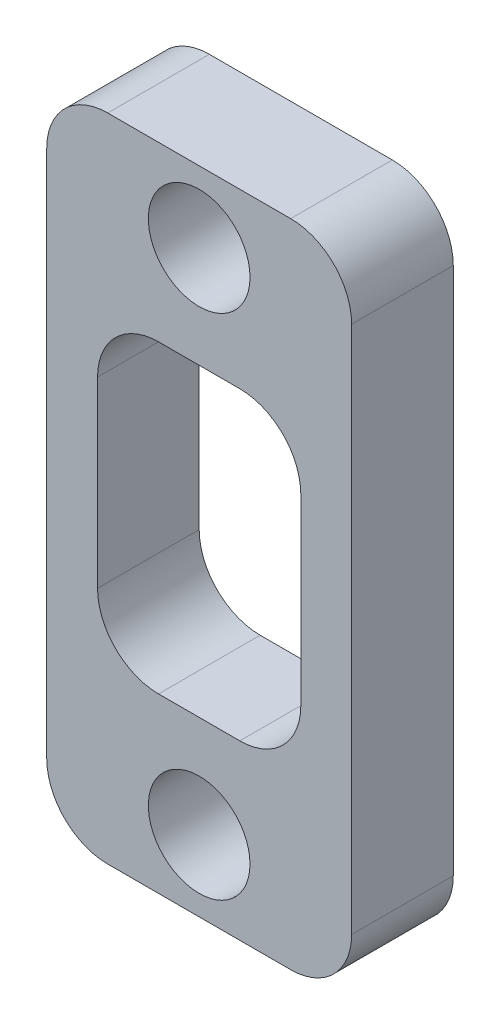
ISO-10303-21;
HEADER;
FILE_DESCRIPTION(('STEP AP214'),'2;1');
FILE_NAME('part.step','',(''),(''),'','','');
FILE_SCHEMA(('AUTOMOTIVE_DESIGN { 1 0 10303 214 1 1 1 1 }'));
ENDSEC;
DATA;
#1=APPLICATION_CONTEXT('core data for automotive mechanical design processes');
#2=APPLICATION_PROTOCOL_DEFINITION('international standard','automotive_design',2000,#1);
#3=PRODUCT_CONTEXT('',#1,'mechanical');
#4=PRODUCT('Part','Part','',(#3));
#5=PRODUCT_RELATED_PRODUCT_CATEGORY('part','',(#4));
#6=PRODUCT_DEFINITION_FORMATION('','',#4);
#7=PRODUCT_DEFINITION_CONTEXT('part definition',#1,'design');
#8=PRODUCT_DEFINITION('design','',#6,#7);
#9=PRODUCT_DEFINITION_SHAPE('','',#8);
#10=(LENGTH_UNIT() NAMED_UNIT(*) SI_UNIT(.MILLI.,.METRE.));
#11=(NAMED_UNIT(*) PLANE_ANGLE_UNIT() SI_UNIT($,.RADIAN.));
#12=(NAMED_UNIT(*) SI_UNIT($,.STERADIAN.) SOLID_ANGLE_UNIT());
#13=UNCERTAINTY_MEASURE_WITH_UNIT(LENGTH_MEASURE(1.E-05),#10,'distance_accuracy_value','');
#14=(GEOMETRIC_REPRESENTATION_CONTEXT(3) GLOBAL_UNCERTAINTY_ASSIGNED_CONTEXT((#13)) GLOBAL_UNIT_ASSIGNED_CONTEXT((#10,
#11,#12)) REPRESENTATION_CONTEXT('',''));
#15=CARTESIAN_POINT('',(0.,0.,0.));
#16=DIRECTION('',(0.,0.,1.));
#17=DIRECTION('',(1.,0.,0.));
#18=AXIS2_PLACEMENT_3D('',#15,#16,#17);
#19=CARTESIAN_POINT('',(0.,0.,5.));
#20=DIRECTION('',(0.,0.,1.));
#21=DIRECTION('',(1.,0.,0.));
#22=AXIS2_PLACEMENT_3D('',#19,#20,#21);
#23=PLANE('',#22);
#24=CARTESIAN_POINT('',(0.,25.,5.));
#25=DIRECTION('',(0.,0.,1.));
#26=DIRECTION('',(1.,0.,0.));
#27=AXIS2_PLACEMENT_3D('',#24,#25,#26);
#28=CIRCLE('',#27,2.5);
#29=CARTESIAN_POINT('',(2.5,25.,5.));
#30=VERTEX_POINT('',#29);
#31=EDGE_CURVE('E283',#30,#30,#28,.T.);
#32=ORIENTED_EDGE('',*,*,#31,.F.);
#33=EDGE_LOOP('',(#32));
#34=FACE_BOUND('',#33,.T.);
#35=DIRECTION('',(0.,-1.,0.));
#36=VECTOR('',#35,1.);
#37=CARTESIAN_POINT('',(-7.5,28.5,5.));
#38=LINE('',#37,#36);
#39=CARTESIAN_POINT('',(-7.5,25.5,5.));
#40=VERTEX_POINT('',#39);
#41=CARTESIAN_POINT('',(-7.5,-0.5,5.));
#42=VERTEX_POINT('',#41);
#43=EDGE_CURVE('E291',#40,#42,#38,.T.);
#44=ORIENTED_EDGE('',*,*,#43,.T.);
#45=CARTESIAN_POINT('',(-4.5,-0.5,5.));
#46=DIRECTION('',(0.,0.,1.));
#47=DIRECTION('',(1.,0.,0.));
#48=AXIS2_PLACEMENT_3D('',#45,#46,#47);
#49=CIRCLE('',#48,3.);
#50=CARTESIAN_POINT('',(-4.5,-3.5,5.));
#51=VERTEX_POINT('',#50);
#52=EDGE_CURVE('E200',#42,#51,#49,.T.);
#53=ORIENTED_EDGE('',*,*,#52,.T.);
#54=DIRECTION('',(1.,0.,0.));
#55=VECTOR('',#54,1.);
#56=CARTESIAN_POINT('',(-7.5,-3.5,5.));
#57=LINE('',#56,#55);
#58=CARTESIAN_POINT('',(4.5,-3.5,5.));
#59=VERTEX_POINT('',#58);
#60=EDGE_CURVE('E169',#51,#59,#57,.T.);
#61=ORIENTED_EDGE('',*,*,#60,.T.);
#62=CARTESIAN_POINT('',(4.5,-0.5,5.));
#63=DIRECTION('',(0.,0.,1.));
#64=DIRECTION('',(1.,0.,0.));
#65=AXIS2_PLACEMENT_3D('',#62,#63,#64);
#66=CIRCLE('',#65,3.);
#67=CARTESIAN_POINT('',(7.5,-0.5,5.));
#68=VERTEX_POINT('',#67);
#69=EDGE_CURVE('E198',#59,#68,#66,.T.);
#70=ORIENTED_EDGE('',*,*,#69,.T.);
#71=DIRECTION('',(0.,1.,0.));
#72=VECTOR('',#71,1.);
#73=CARTESIAN_POINT('',(7.5,28.5,5.));
#74=LINE('',#73,#72);
#75=CARTESIAN_POINT('',(7.5,25.5,5.));
#76=VERTEX_POINT('',#75);
#77=EDGE_CURVE('E176',#68,#76,#74,.T.);
#78=ORIENTED_EDGE('',*,*,#77,.T.);
#79=CARTESIAN_POINT('',(4.5,25.5,5.));
#80=DIRECTION('',(0.,0.,1.));
#81=DIRECTION('',(1.,0.,0.));
#82=AXIS2_PLACEMENT_3D('',#79,#80,#81);
#83=CIRCLE('',#82,3.);
#84=CARTESIAN_POINT('',(4.5,28.5,5.));
#85=VERTEX_POINT('',#84);
#86=EDGE_CURVE('E196',#76,#85,#83,.T.);
#87=ORIENTED_EDGE('',*,*,#86,.T.);
#88=DIRECTION('',(-1.,0.,0.));
#89=VECTOR('',#88,1.);
#90=CARTESIAN_POINT('',(-7.5,28.5,5.));
#91=LINE('',#90,#89);
#92=CARTESIAN_POINT('',(-4.5,28.5,5.));
#93=VERTEX_POINT('',#92);
#94=EDGE_CURVE('E180',#85,#93,#91,.T.);
#95=ORIENTED_EDGE('',*,*,#94,.T.);
#96=CARTESIAN_POINT('',(-4.5,25.5,5.));
#97=DIRECTION('',(0.,0.,1.));
#98=DIRECTION('',(1.,0.,0.));
#99=AXIS2_PLACEMENT_3D('',#96,#97,#98);
#100=CIRCLE('',#99,3.);
#101=EDGE_CURVE('E194',#93,#40,#100,.T.);
#102=ORIENTED_EDGE('',*,*,#101,.T.);
#103=EDGE_LOOP('',(#44,#53,#61,#70,#78,#87,#95,#102));
#104=FACE_BOUND('',#103,.T.);
#105=CARTESIAN_POINT('',(0.,0.,5.));
#106=DIRECTION('',(0.,0.,1.));
#107=DIRECTION('',(1.,0.,0.));
#108=AXIS2_PLACEMENT_3D('',#105,#106,#107);
#109=CIRCLE('',#108,2.5);
#110=CARTESIAN_POINT('',(2.5,0.,5.));
#111=VERTEX_POINT('',#110);
#112=EDGE_CURVE('E277',#111,#111,#109,.T.);
#113=ORIENTED_EDGE('',*,*,#112,.F.);
#114=EDGE_LOOP('',(#113));
#115=FACE_BOUND('',#114,.T.);
#116=DIRECTION('',(-1.,0.,0.));
#117=VECTOR('',#116,1.);
#118=CARTESIAN_POINT('',(-5.,20.,5.));
#119=LINE('',#118,#117);
#120=CARTESIAN_POINT('',(2.,20.,5.));
#121=VERTEX_POINT('',#120);
#122=CARTESIAN_POINT('',(-2.,20.,5.));
#123=VERTEX_POINT('',#122);
#124=EDGE_CURVE('E256',#121,#123,#119,.T.);
#125=ORIENTED_EDGE('',*,*,#124,.F.);
#126=CARTESIAN_POINT('',(2.,17.,5.));
#127=DIRECTION('',(0.,0.,1.));
#128=DIRECTION('',(1.,0.,0.));
#129=AXIS2_PLACEMENT_3D('',#126,#127,#128);
#130=CIRCLE('',#129,3.);
#131=CARTESIAN_POINT('',(5.,17.,5.));
#132=VERTEX_POINT('',#131);
#133=EDGE_CURVE('E240',#121,#132,#130,.F.);
#134=ORIENTED_EDGE('',*,*,#133,.T.);
#135=DIRECTION('',(0.,1.,0.));
#136=VECTOR('',#135,1.);
#137=CARTESIAN_POINT('',(5.,20.,5.));
#138=LINE('',#137,#136);
#139=CARTESIAN_POINT('',(5.,8.,5.));
#140=VERTEX_POINT('',#139);
#141=EDGE_CURVE('E262',#140,#132,#138,.T.);
#142=ORIENTED_EDGE('',*,*,#141,.F.);
#143=CARTESIAN_POINT('',(2.,8.,5.));
#144=DIRECTION('',(0.,0.,1.));
#145=DIRECTION('',(1.,0.,0.));
#146=AXIS2_PLACEMENT_3D('',#143,#144,#145);
#147=CIRCLE('',#146,3.);
#148=CARTESIAN_POINT('',(2.,5.,5.));
#149=VERTEX_POINT('',#148);
#150=EDGE_CURVE('E236',#140,#149,#147,.F.);
#151=ORIENTED_EDGE('',*,*,#150,.T.);
#152=DIRECTION('',(1.,0.,0.));
#153=VECTOR('',#152,1.);
#154=CARTESIAN_POINT('',(-5.,5.,5.));
#155=LINE('',#154,#153);
#156=CARTESIAN_POINT('',(-2.,5.,5.));
#157=VERTEX_POINT('',#156);
#158=EDGE_CURVE('E264',#157,#149,#155,.T.);
#159=ORIENTED_EDGE('',*,*,#158,.F.);
#160=CARTESIAN_POINT('',(-2.,8.,5.));
#161=DIRECTION('',(0.,0.,1.));
#162=DIRECTION('',(1.,0.,0.));
#163=AXIS2_PLACEMENT_3D('',#160,#161,#162);
#164=CIRCLE('',#163,3.);
#165=CARTESIAN_POINT('',(-5.,8.,5.));
#166=VERTEX_POINT('',#165);
#167=EDGE_CURVE('E50',#157,#166,#164,.F.);
#168=ORIENTED_EDGE('',*,*,#167,.T.);
#169=DIRECTION('',(0.,-1.,0.));
#170=VECTOR('',#169,1.);
#171=CARTESIAN_POINT('',(-5.,20.,5.));
#172=LINE('',#171,#170);
#173=CARTESIAN_POINT('',(-5.,17.,5.));
#174=VERTEX_POINT('',#173);
#175=EDGE_CURVE('E258',#174,#166,#172,.T.);
#176=ORIENTED_EDGE('',*,*,#175,.F.);
#177=CARTESIAN_POINT('',(-2.,17.,5.));
#178=DIRECTION('',(0.,0.,1.));
#179=DIRECTION('',(1.,0.,0.));
#180=AXIS2_PLACEMENT_3D('',#177,#178,#179);
#181=CIRCLE('',#180,3.);
#182=EDGE_CURVE('E11',#174,#123,#181,.F.);
#183=ORIENTED_EDGE('',*,*,#182,.T.);
#184=EDGE_LOOP('',(#125,#134,#142,#151,#159,#168,#176,#183));
#185=FACE_BOUND('',#184,.T.);
#186=ADVANCED_FACE('F35',(#34,#104,#115,#185),#23,.T.);
#187=CARTESIAN_POINT('',(0.,0.,0.));
#188=DIRECTION('',(0.,0.,1.));
#189=DIRECTION('',(1.,0.,0.));
#190=AXIS2_PLACEMENT_3D('',#187,#188,#189);
#191=PLANE('',#190);
#192=CARTESIAN_POINT('',(0.,0.,0.));
#193=DIRECTION('',(0.,0.,1.));
#194=DIRECTION('',(1.,0.,0.));
#195=AXIS2_PLACEMENT_3D('',#192,#193,#194);
#196=CIRCLE('',#195,2.5);
#197=CARTESIAN_POINT('',(2.5,0.,0.));
#198=VERTEX_POINT('',#197);
#199=EDGE_CURVE('E271',#198,#198,#196,.T.);
#200=ORIENTED_EDGE('',*,*,#199,.T.);
#201=EDGE_LOOP('',(#200));
#202=FACE_BOUND('',#201,.T.);
#203=CARTESIAN_POINT('',(0.,25.,0.));
#204=DIRECTION('',(0.,0.,1.));
#205=DIRECTION('',(1.,0.,0.));
#206=AXIS2_PLACEMENT_3D('',#203,#204,#205);
#207=CIRCLE('',#206,2.5);
#208=CARTESIAN_POINT('',(2.5,25.,0.));
#209=VERTEX_POINT('',#208);
#210=EDGE_CURVE('E280',#209,#209,#207,.T.);
#211=ORIENTED_EDGE('',*,*,#210,.T.);
#212=EDGE_LOOP('',(#211));
#213=FACE_BOUND('',#212,.T.);
#214=DIRECTION('',(1.,0.,0.));
#215=VECTOR('',#214,1.);
#216=CARTESIAN_POINT('',(-7.5,-3.5,0.));
#217=LINE('',#216,#215);
#218=CARTESIAN_POINT('',(-4.5,-3.5,0.));
#219=VERTEX_POINT('',#218);
#220=CARTESIAN_POINT('',(4.5,-3.5,0.));
#221=VERTEX_POINT('',#220);
#222=EDGE_CURVE('E166',#219,#221,#217,.T.);
#223=ORIENTED_EDGE('',*,*,#222,.F.);
#224=CARTESIAN_POINT('',(-4.5,-0.5,0.));
#225=DIRECTION('',(0.,0.,1.));
#226=DIRECTION('',(1.,0.,0.));
#227=AXIS2_PLACEMENT_3D('',#224,#225,#226);
#228=CIRCLE('',#227,3.);
#229=CARTESIAN_POINT('',(-7.5,-0.5,0.));
#230=VERTEX_POINT('',#229);
#231=EDGE_CURVE('E149',#219,#230,#228,.F.);
#232=ORIENTED_EDGE('',*,*,#231,.T.);
#233=DIRECTION('',(0.,-1.,0.));
#234=VECTOR('',#233,1.);
#235=CARTESIAN_POINT('',(-7.5,28.5,0.));
#236=LINE('',#235,#234);
#237=CARTESIAN_POINT('',(-7.5,25.5,0.));
#238=VERTEX_POINT('',#237);
#239=EDGE_CURVE('E177',#238,#230,#236,.T.);
#240=ORIENTED_EDGE('',*,*,#239,.F.);
#241=CARTESIAN_POINT('',(-4.5,25.5,0.));
#242=DIRECTION('',(0.,0.,1.));
#243=DIRECTION('',(1.,0.,0.));
#244=AXIS2_PLACEMENT_3D('',#241,#242,#243);
#245=CIRCLE('',#244,3.);
#246=CARTESIAN_POINT('',(-4.5,28.5,0.));
#247=VERTEX_POINT('',#246);
#248=EDGE_CURVE('E170',#238,#247,#245,.F.);
#249=ORIENTED_EDGE('',*,*,#248,.T.);
#250=DIRECTION('',(-1.,0.,0.));
#251=VECTOR('',#250,1.);
#252=CARTESIAN_POINT('',(-7.5,28.5,0.));
#253=LINE('',#252,#251);
#254=CARTESIAN_POINT('',(4.5,28.5,0.));
#255=VERTEX_POINT('',#254);
#256=EDGE_CURVE('E182',#255,#247,#253,.T.);
#257=ORIENTED_EDGE('',*,*,#256,.F.);
#258=CARTESIAN_POINT('',(4.5,25.5,0.));
#259=DIRECTION('',(0.,0.,1.));
#260=DIRECTION('',(1.,0.,0.));
#261=AXIS2_PLACEMENT_3D('',#258,#259,#260);
#262=CIRCLE('',#261,3.);
#263=CARTESIAN_POINT('',(7.5,25.5,0.));
#264=VERTEX_POINT('',#263);
#265=EDGE_CURVE('E188',#255,#264,#262,.F.);
#266=ORIENTED_EDGE('',*,*,#265,.T.);
#267=DIRECTION('',(0.,1.,0.));
#268=VECTOR('',#267,1.);
#269=CARTESIAN_POINT('',(7.5,28.5,0.));
#270=LINE('',#269,#268);
#271=CARTESIAN_POINT('',(7.5,-0.5,0.));
#272=VERTEX_POINT('',#271);
#273=EDGE_CURVE('E286',#272,#264,#270,.T.);
#274=ORIENTED_EDGE('',*,*,#273,.F.);
#275=CARTESIAN_POINT('',(4.5,-0.5,0.));
#276=DIRECTION('',(0.,0.,1.));
#277=DIRECTION('',(1.,0.,0.));
#278=AXIS2_PLACEMENT_3D('',#275,#276,#277);
#279=CIRCLE('',#278,3.);
#280=EDGE_CURVE('E160',#272,#221,#279,.F.);
#281=ORIENTED_EDGE('',*,*,#280,.T.);
#282=EDGE_LOOP('',(#223,#232,#240,#249,#257,#266,#274,#281));
#283=FACE_BOUND('',#282,.T.);
#284=DIRECTION('',(1.,0.,0.));
#285=VECTOR('',#284,1.);
#286=CARTESIAN_POINT('',(-5.,5.,0.));
#287=LINE('',#286,#285);
#288=CARTESIAN_POINT('',(-2.,5.,0.));
#289=VERTEX_POINT('',#288);
#290=CARTESIAN_POINT('',(2.,5.,0.));
#291=VERTEX_POINT('',#290);
#292=EDGE_CURVE('E251',#289,#291,#287,.T.);
#293=ORIENTED_EDGE('',*,*,#292,.T.);
#294=CARTESIAN_POINT('',(2.,8.,0.));
#295=DIRECTION('',(0.,0.,1.));
#296=DIRECTION('',(1.,0.,0.));
#297=AXIS2_PLACEMENT_3D('',#294,#295,#296);
#298=CIRCLE('',#297,3.);
#299=CARTESIAN_POINT('',(5.,8.,0.));
#300=VERTEX_POINT('',#299);
#301=EDGE_CURVE('E234',#291,#300,#298,.T.);
#302=ORIENTED_EDGE('',*,*,#301,.T.);
#303=DIRECTION('',(0.,1.,0.));
#304=VECTOR('',#303,1.);
#305=CARTESIAN_POINT('',(5.,20.,0.));
#306=LINE('',#305,#304);
#307=CARTESIAN_POINT('',(5.,17.,0.));
#308=VERTEX_POINT('',#307);
#309=EDGE_CURVE('E272',#300,#308,#306,.T.);
#310=ORIENTED_EDGE('',*,*,#309,.T.);
#311=CARTESIAN_POINT('',(2.,17.,0.));
#312=DIRECTION('',(0.,0.,1.));
#313=DIRECTION('',(1.,0.,0.));
#314=AXIS2_PLACEMENT_3D('',#311,#312,#313);
#315=CIRCLE('',#314,3.);
#316=CARTESIAN_POINT('',(2.,20.,0.));
#317=VERTEX_POINT('',#316);
#318=EDGE_CURVE('E238',#308,#317,#315,.T.);
#319=ORIENTED_EDGE('',*,*,#318,.T.);
#320=DIRECTION('',(-1.,0.,0.));
#321=VECTOR('',#320,1.);
#322=CARTESIAN_POINT('',(-5.,20.,0.));
#323=LINE('',#322,#321);
#324=CARTESIAN_POINT('',(-2.,20.,0.));
#325=VERTEX_POINT('',#324);
#326=EDGE_CURVE('E246',#317,#325,#323,.T.);
#327=ORIENTED_EDGE('',*,*,#326,.T.);
#328=CARTESIAN_POINT('',(-2.,17.,0.));
#329=DIRECTION('',(0.,0.,1.));
#330=DIRECTION('',(1.,0.,0.));
#331=AXIS2_PLACEMENT_3D('',#328,#329,#330);
#332=CIRCLE('',#331,3.);
#333=CARTESIAN_POINT('',(-5.,17.,0.));
#334=VERTEX_POINT('',#333);
#335=EDGE_CURVE('E43',#325,#334,#332,.T.);
#336=ORIENTED_EDGE('',*,*,#335,.T.);
#337=DIRECTION('',(0.,-1.,0.));
#338=VECTOR('',#337,1.);
#339=CARTESIAN_POINT('',(-5.,20.,0.));
#340=LINE('',#339,#338);
#341=CARTESIAN_POINT('',(-5.,8.,0.));
#342=VERTEX_POINT('',#341);
#343=EDGE_CURVE('E244',#334,#342,#340,.T.);
#344=ORIENTED_EDGE('',*,*,#343,.T.);
#345=CARTESIAN_POINT('',(-2.,8.,0.));
#346=DIRECTION('',(0.,0.,1.));
#347=DIRECTION('',(1.,0.,0.));
#348=AXIS2_PLACEMENT_3D('',#345,#346,#347);
#349=CIRCLE('',#348,3.);
#350=EDGE_CURVE('E231',#342,#289,#349,.T.);
#351=ORIENTED_EDGE('',*,*,#350,.T.);
#352=EDGE_LOOP('',(#293,#302,#310,#319,#327,#336,#344,#351));
#353=FACE_BOUND('',#352,.T.);
#354=ADVANCED_FACE('F173',(#202,#213,#283,#353),#191,.F.);
#355=CARTESIAN_POINT('',(7.5,28.5,5.));
#356=DIRECTION('',(-1.,0.,0.));
#357=DIRECTION('',(0.,-1.,0.));
#358=AXIS2_PLACEMENT_3D('',#355,#356,#357);
#359=PLANE('',#358);
#360=ORIENTED_EDGE('',*,*,#77,.F.);
#361=DIRECTION('',(0.,0.,-1.));
#362=VECTOR('',#361,1.);
#363=CARTESIAN_POINT('',(7.5,-0.5,5.));
#364=LINE('',#363,#362);
#365=EDGE_CURVE('E204',#68,#272,#364,.T.);
#366=ORIENTED_EDGE('',*,*,#365,.T.);
#367=ORIENTED_EDGE('',*,*,#273,.T.);
#368=DIRECTION('',(0.,0.,-1.));
#369=VECTOR('',#368,1.);
#370=CARTESIAN_POINT('',(7.5,25.5,5.));
#371=LINE('',#370,#369);
#372=EDGE_CURVE('E202',#264,#76,#371,.F.);
#373=ORIENTED_EDGE('',*,*,#372,.T.);
#374=EDGE_LOOP('',(#360,#366,#367,#373));
#375=FACE_BOUND('',#374,.T.);
#376=ADVANCED_FACE('F320',(#375),#359,.F.);
#377=CARTESIAN_POINT('',(-7.5,28.5,5.));
#378=DIRECTION('',(0.,-1.,0.));
#379=DIRECTION('',(0.,0.,-1.));
#380=AXIS2_PLACEMENT_3D('',#377,#378,#379);
#381=PLANE('',#380);
#382=ORIENTED_EDGE('',*,*,#94,.F.);
#383=DIRECTION('',(0.,0.,-1.));
#384=VECTOR('',#383,1.);
#385=CARTESIAN_POINT('',(4.5,28.5,5.));
#386=LINE('',#385,#384);
#387=EDGE_CURVE('E209',#85,#255,#386,.T.);
#388=ORIENTED_EDGE('',*,*,#387,.T.);
#389=ORIENTED_EDGE('',*,*,#256,.T.);
#390=DIRECTION('',(0.,0.,-1.));
#391=VECTOR('',#390,1.);
#392=CARTESIAN_POINT('',(-4.5,28.5,5.));
#393=LINE('',#392,#391);
#394=EDGE_CURVE('E207',#247,#93,#393,.F.);
#395=ORIENTED_EDGE('',*,*,#394,.T.);
#396=EDGE_LOOP('',(#382,#388,#389,#395));
#397=FACE_BOUND('',#396,.T.);
#398=ADVANCED_FACE('F301',(#397),#381,.F.);
#399=CARTESIAN_POINT('',(-7.5,28.5,5.));
#400=DIRECTION('',(1.,0.,0.));
#401=DIRECTION('',(0.,1.,0.));
#402=AXIS2_PLACEMENT_3D('',#399,#400,#401);
#403=PLANE('',#402);
#404=ORIENTED_EDGE('',*,*,#239,.T.);
#405=DIRECTION('',(0.,0.,-1.));
#406=VECTOR('',#405,1.);
#407=CARTESIAN_POINT('',(-7.5,-0.5,5.));
#408=LINE('',#407,#406);
#409=EDGE_CURVE('E154',#230,#42,#408,.F.);
#410=ORIENTED_EDGE('',*,*,#409,.T.);
#411=ORIENTED_EDGE('',*,*,#43,.F.);
#412=DIRECTION('',(0.,0.,-1.));
#413=VECTOR('',#412,1.);
#414=CARTESIAN_POINT('',(-7.5,25.5,5.));
#415=LINE('',#414,#413);
#416=EDGE_CURVE('E159',#40,#238,#415,.T.);
#417=ORIENTED_EDGE('',*,*,#416,.T.);
#418=EDGE_LOOP('',(#404,#410,#411,#417));
#419=FACE_BOUND('',#418,.T.);
#420=ADVANCED_FACE('F311',(#419),#403,.F.);
#421=CARTESIAN_POINT('',(-7.5,-3.5,5.));
#422=DIRECTION('',(0.,1.,0.));
#423=DIRECTION('',(0.,0.,1.));
#424=AXIS2_PLACEMENT_3D('',#421,#422,#423);
#425=PLANE('',#424);
#426=ORIENTED_EDGE('',*,*,#60,.F.);
#427=DIRECTION('',(0.,0.,-1.));
#428=VECTOR('',#427,1.);
#429=CARTESIAN_POINT('',(-4.5,-3.5,5.));
#430=LINE('',#429,#428);
#431=EDGE_CURVE('E153',#51,#219,#430,.T.);
#432=ORIENTED_EDGE('',*,*,#431,.T.);
#433=ORIENTED_EDGE('',*,*,#222,.T.);
#434=DIRECTION('',(0.,0.,-1.));
#435=VECTOR('',#434,1.);
#436=CARTESIAN_POINT('',(4.5,-3.5,5.));
#437=LINE('',#436,#435);
#438=EDGE_CURVE('E171',#221,#59,#437,.F.);
#439=ORIENTED_EDGE('',*,*,#438,.T.);
#440=EDGE_LOOP('',(#426,#432,#433,#439));
#441=FACE_BOUND('',#440,.T.);
#442=ADVANCED_FACE('F165',(#441),#425,.F.);
#443=CARTESIAN_POINT('',(0.,25.,5.));
#444=DIRECTION('',(0.,0.,-1.));
#445=DIRECTION('',(-1.,0.,0.));
#446=AXIS2_PLACEMENT_3D('',#443,#444,#445);
#447=CYLINDRICAL_SURFACE('',#446,2.5);
#448=ORIENTED_EDGE('',*,*,#31,.T.);
#449=EDGE_LOOP('',(#448));
#450=FACE_BOUND('',#449,.T.);
#451=ORIENTED_EDGE('',*,*,#210,.F.);
#452=EDGE_LOOP('',(#451));
#453=FACE_BOUND('',#452,.T.);
#454=ADVANCED_FACE('F318',(#450,#453),#447,.F.);
#455=CARTESIAN_POINT('',(0.,0.,5.));
#456=DIRECTION('',(0.,0.,-1.));
#457=DIRECTION('',(-1.,0.,0.));
#458=AXIS2_PLACEMENT_3D('',#455,#456,#457);
#459=CYLINDRICAL_SURFACE('',#458,2.5);
#460=ORIENTED_EDGE('',*,*,#112,.T.);
#461=EDGE_LOOP('',(#460));
#462=FACE_BOUND('',#461,.T.);
#463=ORIENTED_EDGE('',*,*,#199,.F.);
#464=EDGE_LOOP('',(#463));
#465=FACE_BOUND('',#464,.T.);
#466=ADVANCED_FACE('F334',(#462,#465),#459,.F.);
#467=CARTESIAN_POINT('',(5.,20.,5.));
#468=DIRECTION('',(-1.,0.,0.));
#469=DIRECTION('',(0.,-1.,0.));
#470=AXIS2_PLACEMENT_3D('',#467,#468,#469);
#471=PLANE('',#470);
#472=ORIENTED_EDGE('',*,*,#309,.F.);
#473=DIRECTION('',(0.,0.,-1.));
#474=VECTOR('',#473,1.);
#475=CARTESIAN_POINT('',(5.,8.,5.));
#476=LINE('',#475,#474);
#477=EDGE_CURVE('E224',#300,#140,#476,.F.);
#478=ORIENTED_EDGE('',*,*,#477,.T.);
#479=ORIENTED_EDGE('',*,*,#141,.T.);
#480=DIRECTION('',(0.,0.,-1.));
#481=VECTOR('',#480,1.);
#482=CARTESIAN_POINT('',(5.,17.,0.));
#483=LINE('',#482,#481);
#484=EDGE_CURVE('E221',#132,#308,#483,.T.);
#485=ORIENTED_EDGE('',*,*,#484,.T.);
#486=EDGE_LOOP('',(#472,#478,#479,#485));
#487=FACE_BOUND('',#486,.T.);
#488=ADVANCED_FACE('F338',(#487),#471,.T.);
#489=CARTESIAN_POINT('',(-5.,20.,5.));
#490=DIRECTION('',(0.,-1.,0.));
#491=DIRECTION('',(0.,0.,-1.));
#492=AXIS2_PLACEMENT_3D('',#489,#490,#491);
#493=PLANE('',#492);
#494=ORIENTED_EDGE('',*,*,#326,.F.);
#495=DIRECTION('',(0.,0.,-1.));
#496=VECTOR('',#495,1.);
#497=CARTESIAN_POINT('',(2.,20.,5.));
#498=LINE('',#497,#496);
#499=EDGE_CURVE('E229',#317,#121,#498,.F.);
#500=ORIENTED_EDGE('',*,*,#499,.T.);
#501=ORIENTED_EDGE('',*,*,#124,.T.);
#502=DIRECTION('',(0.,0.,-1.));
#503=VECTOR('',#502,1.);
#504=CARTESIAN_POINT('',(-2.,20.,0.));
#505=LINE('',#504,#503);
#506=EDGE_CURVE('E226',#123,#325,#505,.T.);
#507=ORIENTED_EDGE('',*,*,#506,.T.);
#508=EDGE_LOOP('',(#494,#500,#501,#507));
#509=FACE_BOUND('',#508,.T.);
#510=ADVANCED_FACE('F260',(#509),#493,.T.);
#511=CARTESIAN_POINT('',(-5.,20.,5.));
#512=DIRECTION('',(1.,0.,0.));
#513=DIRECTION('',(0.,1.,0.));
#514=AXIS2_PLACEMENT_3D('',#511,#512,#513);
#515=PLANE('',#514);
#516=ORIENTED_EDGE('',*,*,#175,.T.);
#517=DIRECTION('',(0.,0.,-1.));
#518=VECTOR('',#517,1.);
#519=CARTESIAN_POINT('',(-5.,8.,0.));
#520=LINE('',#519,#518);
#521=EDGE_CURVE('E213',#166,#342,#520,.T.);
#522=ORIENTED_EDGE('',*,*,#521,.T.);
#523=ORIENTED_EDGE('',*,*,#343,.F.);
#524=DIRECTION('',(0.,0.,-1.));
#525=VECTOR('',#524,1.);
#526=CARTESIAN_POINT('',(-5.,17.,5.));
#527=LINE('',#526,#525);
#528=EDGE_CURVE('E57',#334,#174,#527,.F.);
#529=ORIENTED_EDGE('',*,*,#528,.T.);
#530=EDGE_LOOP('',(#516,#522,#523,#529));
#531=FACE_BOUND('',#530,.T.);
#532=ADVANCED_FACE('F249',(#531),#515,.T.);
#533=CARTESIAN_POINT('',(-5.,5.,5.));
#534=DIRECTION('',(0.,1.,0.));
#535=DIRECTION('',(0.,0.,1.));
#536=AXIS2_PLACEMENT_3D('',#533,#534,#535);
#537=PLANE('',#536);
#538=ORIENTED_EDGE('',*,*,#292,.F.);
#539=DIRECTION('',(0.,0.,-1.));
#540=VECTOR('',#539,1.);
#541=CARTESIAN_POINT('',(-2.,5.,5.));
#542=LINE('',#541,#540);
#543=EDGE_CURVE('E219',#289,#157,#542,.F.);
#544=ORIENTED_EDGE('',*,*,#543,.T.);
#545=ORIENTED_EDGE('',*,*,#158,.T.);
#546=DIRECTION('',(0.,0.,-1.));
#547=VECTOR('',#546,1.);
#548=CARTESIAN_POINT('',(2.,5.,0.));
#549=LINE('',#548,#547);
#550=EDGE_CURVE('E216',#149,#291,#549,.T.);
#551=ORIENTED_EDGE('',*,*,#550,.T.);
#552=EDGE_LOOP('',(#538,#544,#545,#551));
#553=FACE_BOUND('',#552,.T.);
#554=ADVANCED_FACE('F347',(#553),#537,.T.);
#555=CARTESIAN_POINT('',(-4.5,-0.5,5.));
#556=DIRECTION('',(0.,0.,-1.));
#557=DIRECTION('',(-1.,0.,0.));
#558=AXIS2_PLACEMENT_3D('',#555,#556,#557);
#559=CYLINDRICAL_SURFACE('',#558,3.);
#560=ORIENTED_EDGE('',*,*,#52,.F.);
#561=ORIENTED_EDGE('',*,*,#409,.F.);
#562=ORIENTED_EDGE('',*,*,#231,.F.);
#563=ORIENTED_EDGE('',*,*,#431,.F.);
#564=EDGE_LOOP('',(#560,#561,#562,#563));
#565=FACE_BOUND('',#564,.T.);
#566=ADVANCED_FACE('F152',(#565),#559,.T.);
#567=CARTESIAN_POINT('',(4.5,-0.5,5.));
#568=DIRECTION('',(0.,0.,-1.));
#569=DIRECTION('',(-1.,0.,0.));
#570=AXIS2_PLACEMENT_3D('',#567,#568,#569);
#571=CYLINDRICAL_SURFACE('',#570,3.);
#572=ORIENTED_EDGE('',*,*,#69,.F.);
#573=ORIENTED_EDGE('',*,*,#438,.F.);
#574=ORIENTED_EDGE('',*,*,#280,.F.);
#575=ORIENTED_EDGE('',*,*,#365,.F.);
#576=EDGE_LOOP('',(#572,#573,#574,#575));
#577=FACE_BOUND('',#576,.T.);
#578=ADVANCED_FACE('F353',(#577),#571,.T.);
#579=CARTESIAN_POINT('',(4.5,25.5,5.));
#580=DIRECTION('',(0.,0.,-1.));
#581=DIRECTION('',(-1.,0.,0.));
#582=AXIS2_PLACEMENT_3D('',#579,#580,#581);
#583=CYLINDRICAL_SURFACE('',#582,3.);
#584=ORIENTED_EDGE('',*,*,#86,.F.);
#585=ORIENTED_EDGE('',*,*,#372,.F.);
#586=ORIENTED_EDGE('',*,*,#265,.F.);
#587=ORIENTED_EDGE('',*,*,#387,.F.);
#588=EDGE_LOOP('',(#584,#585,#586,#587));
#589=FACE_BOUND('',#588,.T.);
#590=ADVANCED_FACE('F370',(#589),#583,.T.);
#591=CARTESIAN_POINT('',(-4.5,25.5,5.));
#592=DIRECTION('',(0.,0.,-1.));
#593=DIRECTION('',(-1.,0.,0.));
#594=AXIS2_PLACEMENT_3D('',#591,#592,#593);
#595=CYLINDRICAL_SURFACE('',#594,3.);
#596=ORIENTED_EDGE('',*,*,#101,.F.);
#597=ORIENTED_EDGE('',*,*,#394,.F.);
#598=ORIENTED_EDGE('',*,*,#248,.F.);
#599=ORIENTED_EDGE('',*,*,#416,.F.);
#600=EDGE_LOOP('',(#596,#597,#598,#599));
#601=FACE_BOUND('',#600,.T.);
#602=ADVANCED_FACE('F305',(#601),#595,.T.);
#603=CARTESIAN_POINT('',(-2.,8.,5.));
#604=DIRECTION('',(0.,0.,1.));
#605=DIRECTION('',(1.,0.,0.));
#606=AXIS2_PLACEMENT_3D('',#603,#604,#605);
#607=CYLINDRICAL_SURFACE('',#606,3.);
#608=ORIENTED_EDGE('',*,*,#167,.F.);
#609=ORIENTED_EDGE('',*,*,#543,.F.);
#610=ORIENTED_EDGE('',*,*,#350,.F.);
#611=ORIENTED_EDGE('',*,*,#521,.F.);
#612=EDGE_LOOP('',(#608,#609,#610,#611));
#613=FACE_BOUND('',#612,.T.);
#614=ADVANCED_FACE('F359',(#613),#607,.F.);
#615=CARTESIAN_POINT('',(2.,8.,5.));
#616=DIRECTION('',(0.,0.,1.));
#617=DIRECTION('',(1.,0.,0.));
#618=AXIS2_PLACEMENT_3D('',#615,#616,#617);
#619=CYLINDRICAL_SURFACE('',#618,3.);
#620=ORIENTED_EDGE('',*,*,#150,.F.);
#621=ORIENTED_EDGE('',*,*,#477,.F.);
#622=ORIENTED_EDGE('',*,*,#301,.F.);
#623=ORIENTED_EDGE('',*,*,#550,.F.);
#624=EDGE_LOOP('',(#620,#621,#622,#623));
#625=FACE_BOUND('',#624,.T.);
#626=ADVANCED_FACE('F361',(#625),#619,.F.);
#627=CARTESIAN_POINT('',(2.,17.,5.));
#628=DIRECTION('',(0.,0.,1.));
#629=DIRECTION('',(1.,0.,0.));
#630=AXIS2_PLACEMENT_3D('',#627,#628,#629);
#631=CYLINDRICAL_SURFACE('',#630,3.);
#632=ORIENTED_EDGE('',*,*,#133,.F.);
#633=ORIENTED_EDGE('',*,*,#499,.F.);
#634=ORIENTED_EDGE('',*,*,#318,.F.);
#635=ORIENTED_EDGE('',*,*,#484,.F.);
#636=EDGE_LOOP('',(#632,#633,#634,#635));
#637=FACE_BOUND('',#636,.T.);
#638=ADVANCED_FACE('F367',(#637),#631,.F.);
#639=CARTESIAN_POINT('',(-2.,17.,5.));
#640=DIRECTION('',(0.,0.,1.));
#641=DIRECTION('',(1.,0.,0.));
#642=AXIS2_PLACEMENT_3D('',#639,#640,#641);
#643=CYLINDRICAL_SURFACE('',#642,3.);
#644=ORIENTED_EDGE('',*,*,#182,.F.);
#645=ORIENTED_EDGE('',*,*,#528,.F.);
#646=ORIENTED_EDGE('',*,*,#335,.F.);
#647=ORIENTED_EDGE('',*,*,#506,.F.);
#648=EDGE_LOOP('',(#644,#645,#646,#647));
#649=FACE_BOUND('',#648,.T.);
#650=ADVANCED_FACE('F37',(#649),#643,.F.);
#651=CLOSED_SHELL('',(#186,#354,#376,#398,#420,#442,#454,#466,#488,#510,#532,#554,#566,#578,
#590,#602,#614,#626,#638,#650));
#652=MANIFOLD_SOLID_BREP('B2',#651);
#653=ADVANCED_BREP_SHAPE_REPRESENTATION('',(#18,#652),#14);
#654=SHAPE_DEFINITION_REPRESENTATION(#9,#653);
ENDSEC;
END-ISO-10303-21;
